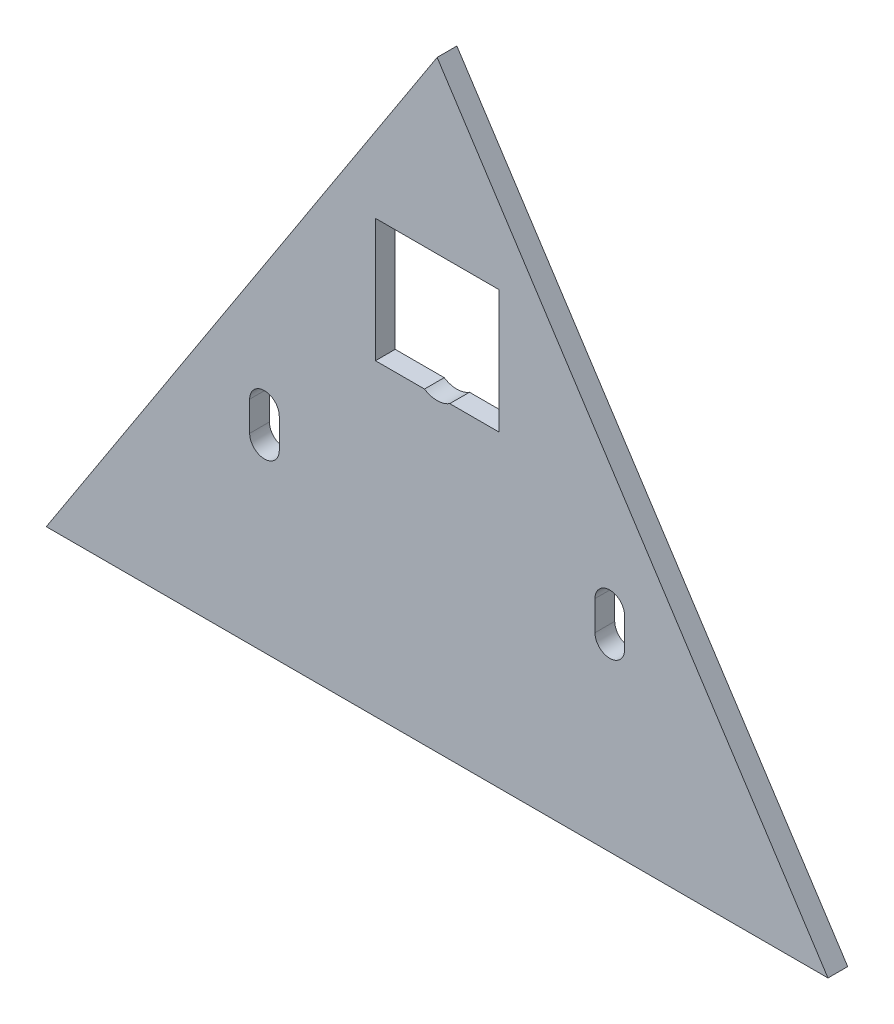
ISO-10303-21;
HEADER;
FILE_DESCRIPTION(('STEP AP214'),'2;1');
FILE_NAME('part.step','',(''),(''),'','','');
FILE_SCHEMA(('AUTOMOTIVE_DESIGN { 1 0 10303 214 1 1 1 1 }'));
ENDSEC;
DATA;
#1=APPLICATION_CONTEXT('core data for automotive mechanical design processes');
#2=APPLICATION_PROTOCOL_DEFINITION('international standard','automotive_design',2000,#1);
#3=PRODUCT_CONTEXT('',#1,'mechanical');
#4=PRODUCT('Part','Part','',(#3));
#5=PRODUCT_RELATED_PRODUCT_CATEGORY('part','',(#4));
#6=PRODUCT_DEFINITION_FORMATION('','',#4);
#7=PRODUCT_DEFINITION_CONTEXT('part definition',#1,'design');
#8=PRODUCT_DEFINITION('design','',#6,#7);
#9=PRODUCT_DEFINITION_SHAPE('','',#8);
#10=(LENGTH_UNIT() NAMED_UNIT(*) SI_UNIT(.MILLI.,.METRE.));
#11=(NAMED_UNIT(*) PLANE_ANGLE_UNIT() SI_UNIT($,.RADIAN.));
#12=(NAMED_UNIT(*) SI_UNIT($,.STERADIAN.) SOLID_ANGLE_UNIT());
#13=UNCERTAINTY_MEASURE_WITH_UNIT(LENGTH_MEASURE(1.E-05),#10,'distance_accuracy_value','');
#14=(GEOMETRIC_REPRESENTATION_CONTEXT(3) GLOBAL_UNCERTAINTY_ASSIGNED_CONTEXT((#13)) GLOBAL_UNIT_ASSIGNED_CONTEXT((#10,
#11,#12)) REPRESENTATION_CONTEXT('',''));
#15=CARTESIAN_POINT('',(0.,0.,0.));
#16=DIRECTION('',(0.,0.,1.));
#17=DIRECTION('',(1.,0.,0.));
#18=AXIS2_PLACEMENT_3D('',#15,#16,#17);
#19=CARTESIAN_POINT('',(24.9999999999998,453.506957122001,-32.0000000000005));
#20=DIRECTION('',(0.,-1.,0.));
#21=DIRECTION('',(0.,0.,-1.));
#22=AXIS2_PLACEMENT_3D('',#19,#20,#21);
#23=PLANE('',#22);
#24=DIRECTION('',(-1.,0.,0.));
#25=VECTOR('',#24,1.);
#26=CARTESIAN_POINT('',(24.9999999999998,453.506957122001,-32.0000000000005));
#27=LINE('',#26,#25);
#28=CARTESIAN_POINT('',(-5.12347538297992,453.506957122001,-32.0000000000004));
#29=VERTEX_POINT('',#28);
#30=CARTESIAN_POINT('',(-25.0000000000002,453.506957122001,-32.0000000000003));
#31=VERTEX_POINT('',#30);
#32=EDGE_CURVE('E278',#29,#31,#27,.T.);
#33=ORIENTED_EDGE('',*,*,#32,.F.);
#34=DIRECTION('',(0.,0.,-1.));
#35=VECTOR('',#34,1.);
#36=CARTESIAN_POINT('',(-5.12347538297991,453.506957122001,-30.0000000000004));
#37=LINE('',#36,#35);
#38=CARTESIAN_POINT('',(-5.12347538297994,453.506957122001,-40.0000000000004));
#39=VERTEX_POINT('',#38);
#40=EDGE_CURVE('E12',#29,#39,#37,.T.);
#41=ORIENTED_EDGE('',*,*,#40,.T.);
#42=DIRECTION('',(-1.,0.,0.));
#43=VECTOR('',#42,1.);
#44=CARTESIAN_POINT('',(24.9999999999998,453.506957122001,-40.0000000000005));
#45=LINE('',#44,#43);
#46=CARTESIAN_POINT('',(-25.0000000000002,453.506957122001,-40.0000000000003));
#47=VERTEX_POINT('',#46);
#48=EDGE_CURVE('E180',#39,#47,#45,.T.);
#49=ORIENTED_EDGE('',*,*,#48,.T.);
#50=DIRECTION('',(0.,0.,-1.));
#51=VECTOR('',#50,1.);
#52=CARTESIAN_POINT('',(-25.0000000000002,453.506957122001,-32.0000000000003));
#53=LINE('',#52,#51);
#54=EDGE_CURVE('E200',#31,#47,#53,.T.);
#55=ORIENTED_EDGE('',*,*,#54,.F.);
#56=EDGE_LOOP('',(#33,#41,#49,#55));
#57=FACE_BOUND('',#56,.T.);
#58=ADVANCED_FACE('F46',(#57),#23,.F.);
#59=CARTESIAN_POINT('',(-158.455452740194,328.506957122001,-32.0000000000002));
#60=DIRECTION('',(-0.838670567945421,0.544639035015032,0.));
#61=DIRECTION('',(-0.544639035015032,-0.838670567945421,0.));
#62=AXIS2_PLACEMENT_3D('',#59,#60,#61);
#63=PLANE('',#62);
#64=DIRECTION('',(0.544639035015032,0.838670567945421,0.));
#65=VECTOR('',#64,1.);
#66=CARTESIAN_POINT('',(-158.455452740194,328.506957122001,-40.0000000000002));
#67=LINE('',#66,#65);
#68=CARTESIAN_POINT('',(-158.455452740194,328.506957122001,-40.0000000000002));
#69=VERTEX_POINT('',#68);
#70=CARTESIAN_POINT('',(0.,572.506957122,-40.0000000000002));
#71=VERTEX_POINT('',#70);
#72=EDGE_CURVE('E204',#69,#71,#67,.T.);
#73=ORIENTED_EDGE('',*,*,#72,.F.);
#74=DIRECTION('',(0.,0.,-1.));
#75=VECTOR('',#74,1.);
#76=CARTESIAN_POINT('',(-158.455452740194,328.506957122001,-32.0000000000002));
#77=LINE('',#76,#75);
#78=CARTESIAN_POINT('',(-158.455452740194,328.506957122001,-32.0000000000002));
#79=VERTEX_POINT('',#78);
#80=EDGE_CURVE('E171',#79,#69,#77,.T.);
#81=ORIENTED_EDGE('',*,*,#80,.F.);
#82=DIRECTION('',(0.544639035015032,0.838670567945421,0.));
#83=VECTOR('',#82,1.);
#84=CARTESIAN_POINT('',(-158.455452740194,328.506957122001,-32.0000000000002));
#85=LINE('',#84,#83);
#86=CARTESIAN_POINT('',(0.,572.506957122,-32.0000000000002));
#87=VERTEX_POINT('',#86);
#88=EDGE_CURVE('E215',#79,#87,#85,.T.);
#89=ORIENTED_EDGE('',*,*,#88,.T.);
#90=DIRECTION('',(0.,0.,-1.));
#91=VECTOR('',#90,1.);
#92=CARTESIAN_POINT('',(0.,572.506957122,-32.0000000000002));
#93=LINE('',#92,#91);
#94=EDGE_CURVE('E232',#87,#71,#93,.T.);
#95=ORIENTED_EDGE('',*,*,#94,.T.);
#96=EDGE_LOOP('',(#73,#81,#89,#95));
#97=FACE_BOUND('',#96,.T.);
#98=ADVANCED_FACE('F48',(#97),#63,.T.);
#99=CARTESIAN_POINT('',(158.455452740191,328.506957122001,-32.0000000000012));
#100=DIRECTION('',(0.,-1.,0.));
#101=DIRECTION('',(0.,0.,-1.));
#102=AXIS2_PLACEMENT_3D('',#99,#100,#101);
#103=PLANE('',#102);
#104=DIRECTION('',(-1.,0.,0.));
#105=VECTOR('',#104,1.);
#106=CARTESIAN_POINT('',(158.455452740191,328.506957122001,-40.0000000000012));
#107=LINE('',#106,#105);
#108=CARTESIAN_POINT('',(158.455452740191,328.506957122001,-40.0000000000012));
#109=VERTEX_POINT('',#108);
#110=EDGE_CURVE('E220',#109,#69,#107,.T.);
#111=ORIENTED_EDGE('',*,*,#110,.F.);
#112=DIRECTION('',(0.,0.,-1.));
#113=VECTOR('',#112,1.);
#114=CARTESIAN_POINT('',(158.455452740191,328.506957122001,-32.0000000000012));
#115=LINE('',#114,#113);
#116=CARTESIAN_POINT('',(158.455452740191,328.506957122001,-32.0000000000012));
#117=VERTEX_POINT('',#116);
#118=EDGE_CURVE('E245',#117,#109,#115,.T.);
#119=ORIENTED_EDGE('',*,*,#118,.F.);
#120=DIRECTION('',(-1.,0.,0.));
#121=VECTOR('',#120,1.);
#122=CARTESIAN_POINT('',(158.455452740191,328.506957122001,-32.0000000000012));
#123=LINE('',#122,#121);
#124=EDGE_CURVE('E227',#117,#79,#123,.T.);
#125=ORIENTED_EDGE('',*,*,#124,.T.);
#126=ORIENTED_EDGE('',*,*,#80,.T.);
#127=EDGE_LOOP('',(#111,#119,#125,#126));
#128=FACE_BOUND('',#127,.T.);
#129=ADVANCED_FACE('F262',(#128),#103,.T.);
#130=CARTESIAN_POINT('',(0.,572.506957122,-32.0000000000002));
#131=DIRECTION('',(0.838670567945427,0.544639035015022,0.));
#132=DIRECTION('',(-0.544639035015022,0.838670567945427,0.));
#133=AXIS2_PLACEMENT_3D('',#130,#131,#132);
#134=PLANE('',#133);
#135=DIRECTION('',(0.544639035015022,-0.838670567945427,0.));
#136=VECTOR('',#135,1.);
#137=CARTESIAN_POINT('',(0.,572.506957122,-40.0000000000002));
#138=LINE('',#137,#136);
#139=EDGE_CURVE('E236',#71,#109,#138,.T.);
#140=ORIENTED_EDGE('',*,*,#139,.F.);
#141=ORIENTED_EDGE('',*,*,#94,.F.);
#142=DIRECTION('',(0.544639035015022,-0.838670567945427,0.));
#143=VECTOR('',#142,1.);
#144=CARTESIAN_POINT('',(0.,572.506957122,-32.0000000000002));
#145=LINE('',#144,#143);
#146=EDGE_CURVE('E219',#87,#117,#145,.T.);
#147=ORIENTED_EDGE('',*,*,#146,.T.);
#148=ORIENTED_EDGE('',*,*,#118,.T.);
#149=EDGE_LOOP('',(#140,#141,#147,#148));
#150=FACE_BOUND('',#149,.T.);
#151=ADVANCED_FACE('F258',(#150),#134,.T.);
#152=CARTESIAN_POINT('',(-1.02960238396592E-13,0.,-32.0000000000014));
#153=DIRECTION('',(0.,0.,-1.));
#154=DIRECTION('',(-1.,0.,0.));
#155=AXIS2_PLACEMENT_3D('',#152,#153,#154);
#156=PLANE('',#155);
#157=DIRECTION('',(0.,1.,0.));
#158=VECTOR('',#157,1.);
#159=CARTESIAN_POINT('',(-76.0000000000002,414.506957122,-32.0000000000003));
#160=LINE('',#159,#158);
#161=CARTESIAN_POINT('',(-76.0000000000002,402.506957122001,-32.0000000000003));
#162=VERTEX_POINT('',#161);
#163=CARTESIAN_POINT('',(-76.0000000000002,414.506957122,-32.0000000000003));
#164=VERTEX_POINT('',#163);
#165=EDGE_CURVE('E331',#162,#164,#160,.T.);
#166=ORIENTED_EDGE('',*,*,#165,.T.);
#167=CARTESIAN_POINT('',(-70.0000000000001,414.506957122001,-32.0000000000003));
#168=DIRECTION('',(0.,0.,-1.));
#169=DIRECTION('',(1.,0.,0.));
#170=AXIS2_PLACEMENT_3D('',#167,#168,#169);
#171=CIRCLE('',#170,6.00000000000005);
#172=CARTESIAN_POINT('',(-64.0000000000001,414.506957122,-32.0000000000003));
#173=VERTEX_POINT('',#172);
#174=EDGE_CURVE('E339',#164,#173,#171,.T.);
#175=ORIENTED_EDGE('',*,*,#174,.T.);
#176=DIRECTION('',(0.,-1.,0.));
#177=VECTOR('',#176,1.);
#178=CARTESIAN_POINT('',(-64.0000000000001,414.506957122,-32.0000000000003));
#179=LINE('',#178,#177);
#180=CARTESIAN_POINT('',(-64.0000000000001,402.506957122001,-32.0000000000003));
#181=VERTEX_POINT('',#180);
#182=EDGE_CURVE('E332',#173,#181,#179,.T.);
#183=ORIENTED_EDGE('',*,*,#182,.T.);
#184=CARTESIAN_POINT('',(-70.0000000000001,402.506957122001,-32.0000000000003));
#185=DIRECTION('',(0.,0.,-1.));
#186=DIRECTION('',(1.,0.,0.));
#187=AXIS2_PLACEMENT_3D('',#184,#185,#186);
#188=CIRCLE('',#187,6.00000000000005);
#189=EDGE_CURVE('E70',#181,#162,#188,.T.);
#190=ORIENTED_EDGE('',*,*,#189,.T.);
#191=EDGE_LOOP('',(#166,#175,#183,#190));
#192=FACE_BOUND('',#191,.T.);
#193=DIRECTION('',(0.,1.,0.));
#194=VECTOR('',#193,1.);
#195=CARTESIAN_POINT('',(63.9999999999999,414.506957122,-32.0000000000007));
#196=LINE('',#195,#194);
#197=CARTESIAN_POINT('',(63.9999999999999,402.506957122001,-32.0000000000007));
#198=VERTEX_POINT('',#197);
#199=CARTESIAN_POINT('',(63.9999999999999,414.506957122,-32.0000000000007));
#200=VERTEX_POINT('',#199);
#201=EDGE_CURVE('E305',#198,#200,#196,.T.);
#202=ORIENTED_EDGE('',*,*,#201,.T.);
#203=CARTESIAN_POINT('',(69.9999999999999,414.506957122001,-32.0000000000007));
#204=DIRECTION('',(0.,0.,-1.));
#205=DIRECTION('',(-1.,0.,0.));
#206=AXIS2_PLACEMENT_3D('',#203,#204,#205);
#207=CIRCLE('',#206,6.00000000000005);
#208=CARTESIAN_POINT('',(76.,414.506957122,-32.0000000000008));
#209=VERTEX_POINT('',#208);
#210=EDGE_CURVE('E313',#200,#209,#207,.T.);
#211=ORIENTED_EDGE('',*,*,#210,.T.);
#212=DIRECTION('',(0.,-1.,0.));
#213=VECTOR('',#212,1.);
#214=CARTESIAN_POINT('',(76.,414.506957122,-32.0000000000008));
#215=LINE('',#214,#213);
#216=CARTESIAN_POINT('',(76.,402.506957122001,-32.0000000000008));
#217=VERTEX_POINT('',#216);
#218=EDGE_CURVE('E306',#209,#217,#215,.T.);
#219=ORIENTED_EDGE('',*,*,#218,.T.);
#220=CARTESIAN_POINT('',(69.9999999999999,402.506957122001,-32.0000000000008));
#221=DIRECTION('',(0.,0.,-1.));
#222=DIRECTION('',(-1.,0.,0.));
#223=AXIS2_PLACEMENT_3D('',#220,#221,#222);
#224=CIRCLE('',#223,6.00000000000005);
#225=EDGE_CURVE('E301',#217,#198,#224,.T.);
#226=ORIENTED_EDGE('',*,*,#225,.T.);
#227=EDGE_LOOP('',(#202,#211,#219,#226));
#228=FACE_BOUND('',#227,.T.);
#229=CARTESIAN_POINT('',(24.9999999999998,453.506957122001,-32.0000000000005));
#230=VERTEX_POINT('',#229);
#231=CARTESIAN_POINT('',(5.12347538297969,453.506957122001,-32.0000000000004));
#232=VERTEX_POINT('',#231);
#233=EDGE_CURVE('E214',#230,#232,#27,.T.);
#234=ORIENTED_EDGE('',*,*,#233,.T.);
#235=CARTESIAN_POINT('',(-1.06382445730871E-13,461.506957122001,-32.0000000000004));
#236=DIRECTION('',(0.,0.,-1.));
#237=DIRECTION('',(-1.,0.,0.));
#238=AXIS2_PLACEMENT_3D('',#235,#236,#237);
#239=CIRCLE('',#238,9.50000000000001);
#240=EDGE_CURVE('E62',#232,#29,#239,.T.);
#241=ORIENTED_EDGE('',*,*,#240,.T.);
#242=ORIENTED_EDGE('',*,*,#32,.T.);
#243=DIRECTION('',(0.,1.,0.));
#244=VECTOR('',#243,1.);
#245=CARTESIAN_POINT('',(-25.0000000000002,503.506957122,-32.0000000000002));
#246=LINE('',#245,#244);
#247=CARTESIAN_POINT('',(-25.0000000000002,503.506957122,-32.0000000000002));
#248=VERTEX_POINT('',#247);
#249=EDGE_CURVE('E187',#31,#248,#246,.T.);
#250=ORIENTED_EDGE('',*,*,#249,.T.);
#251=DIRECTION('',(1.,0.,0.));
#252=VECTOR('',#251,1.);
#253=CARTESIAN_POINT('',(24.9999999999998,503.506957122001,-32.0000000000004));
#254=LINE('',#253,#252);
#255=CARTESIAN_POINT('',(24.9999999999998,503.506957122001,-32.0000000000004));
#256=VERTEX_POINT('',#255);
#257=EDGE_CURVE('E193',#248,#256,#254,.T.);
#258=ORIENTED_EDGE('',*,*,#257,.T.);
#259=DIRECTION('',(0.,-1.,0.));
#260=VECTOR('',#259,1.);
#261=CARTESIAN_POINT('',(24.9999999999998,503.506957122001,-32.0000000000004));
#262=LINE('',#261,#260);
#263=EDGE_CURVE('E274',#256,#230,#262,.T.);
#264=ORIENTED_EDGE('',*,*,#263,.T.);
#265=EDGE_LOOP('',(#234,#241,#242,#250,#258,#264));
#266=FACE_BOUND('',#265,.T.);
#267=ORIENTED_EDGE('',*,*,#88,.F.);
#268=ORIENTED_EDGE('',*,*,#124,.F.);
#269=ORIENTED_EDGE('',*,*,#146,.F.);
#270=EDGE_LOOP('',(#267,#268,#269));
#271=FACE_BOUND('',#270,.T.);
#272=ADVANCED_FACE('F265',(#192,#228,#266,#271),#156,.F.);
#273=CARTESIAN_POINT('',(-1.28745005139942E-13,0.,-40.0000000000014));
#274=DIRECTION('',(0.,0.,-1.));
#275=DIRECTION('',(-1.,0.,0.));
#276=AXIS2_PLACEMENT_3D('',#273,#274,#275);
#277=PLANE('',#276);
#278=CARTESIAN_POINT('',(-1.32214452091896E-13,461.506957122001,-40.0000000000004));
#279=DIRECTION('',(0.,0.,-1.));
#280=DIRECTION('',(-1.,0.,0.));
#281=AXIS2_PLACEMENT_3D('',#278,#279,#280);
#282=CIRCLE('',#281,9.50000000000001);
#283=CARTESIAN_POINT('',(5.12347538297968,453.506957122001,-40.0000000000004));
#284=VERTEX_POINT('',#283);
#285=EDGE_CURVE('E165',#284,#39,#282,.T.);
#286=ORIENTED_EDGE('',*,*,#285,.F.);
#287=CARTESIAN_POINT('',(24.9999999999998,453.506957122001,-40.0000000000005));
#288=VERTEX_POINT('',#287);
#289=EDGE_CURVE('E178',#288,#284,#45,.T.);
#290=ORIENTED_EDGE('',*,*,#289,.F.);
#291=DIRECTION('',(0.,-1.,0.));
#292=VECTOR('',#291,1.);
#293=CARTESIAN_POINT('',(24.9999999999998,503.506957122001,-40.0000000000004));
#294=LINE('',#293,#292);
#295=CARTESIAN_POINT('',(24.9999999999998,503.506957122001,-40.0000000000004));
#296=VERTEX_POINT('',#295);
#297=EDGE_CURVE('E196',#296,#288,#294,.T.);
#298=ORIENTED_EDGE('',*,*,#297,.F.);
#299=DIRECTION('',(1.,0.,0.));
#300=VECTOR('',#299,1.);
#301=CARTESIAN_POINT('',(24.9999999999998,503.506957122001,-40.0000000000004));
#302=LINE('',#301,#300);
#303=CARTESIAN_POINT('',(-25.0000000000002,503.506957122001,-40.0000000000002));
#304=VERTEX_POINT('',#303);
#305=EDGE_CURVE('E669',#304,#296,#302,.T.);
#306=ORIENTED_EDGE('',*,*,#305,.F.);
#307=DIRECTION('',(0.,1.,0.));
#308=VECTOR('',#307,1.);
#309=CARTESIAN_POINT('',(-25.0000000000002,503.506957122,-40.0000000000002));
#310=LINE('',#309,#308);
#311=EDGE_CURVE('E392',#47,#304,#310,.T.);
#312=ORIENTED_EDGE('',*,*,#311,.F.);
#313=ORIENTED_EDGE('',*,*,#48,.F.);
#314=EDGE_LOOP('',(#286,#290,#298,#306,#312,#313));
#315=FACE_BOUND('',#314,.T.);
#316=CARTESIAN_POINT('',(-70.0000000000001,414.506957122001,-40.0000000000003));
#317=DIRECTION('',(0.,0.,-1.));
#318=DIRECTION('',(1.,0.,0.));
#319=AXIS2_PLACEMENT_3D('',#316,#317,#318);
#320=CIRCLE('',#319,6.00000000000005);
#321=CARTESIAN_POINT('',(-76.0000000000002,414.506957122,-40.0000000000003));
#322=VERTEX_POINT('',#321);
#323=CARTESIAN_POINT('',(-64.0000000000001,414.506957122,-40.0000000000003));
#324=VERTEX_POINT('',#323);
#325=EDGE_CURVE('E295',#322,#324,#320,.T.);
#326=ORIENTED_EDGE('',*,*,#325,.F.);
#327=DIRECTION('',(0.,1.,0.));
#328=VECTOR('',#327,1.);
#329=CARTESIAN_POINT('',(-76.0000000000002,414.506957122,-40.0000000000003));
#330=LINE('',#329,#328);
#331=CARTESIAN_POINT('',(-76.0000000000002,402.506957122001,-40.0000000000003));
#332=VERTEX_POINT('',#331);
#333=EDGE_CURVE('E345',#332,#322,#330,.T.);
#334=ORIENTED_EDGE('',*,*,#333,.F.);
#335=CARTESIAN_POINT('',(-70.0000000000001,402.506957122001,-40.0000000000003));
#336=DIRECTION('',(0.,0.,-1.));
#337=DIRECTION('',(1.,0.,0.));
#338=AXIS2_PLACEMENT_3D('',#335,#336,#337);
#339=CIRCLE('',#338,6.00000000000005);
#340=CARTESIAN_POINT('',(-64.0000000000001,402.506957122001,-40.0000000000003));
#341=VERTEX_POINT('',#340);
#342=EDGE_CURVE('E423',#341,#332,#339,.T.);
#343=ORIENTED_EDGE('',*,*,#342,.F.);
#344=DIRECTION('',(0.,-1.,0.));
#345=VECTOR('',#344,1.);
#346=CARTESIAN_POINT('',(-64.0000000000001,414.506957122,-40.0000000000003));
#347=LINE('',#346,#345);
#348=EDGE_CURVE('E427',#324,#341,#347,.T.);
#349=ORIENTED_EDGE('',*,*,#348,.F.);
#350=EDGE_LOOP('',(#326,#334,#343,#349));
#351=FACE_BOUND('',#350,.T.);
#352=CARTESIAN_POINT('',(69.9999999999999,414.506957122001,-40.0000000000007));
#353=DIRECTION('',(0.,0.,-1.));
#354=DIRECTION('',(-1.,0.,0.));
#355=AXIS2_PLACEMENT_3D('',#352,#353,#354);
#356=CIRCLE('',#355,6.00000000000005);
#357=CARTESIAN_POINT('',(63.9999999999998,414.506957122,-40.0000000000007));
#358=VERTEX_POINT('',#357);
#359=CARTESIAN_POINT('',(75.9999999999999,414.506957122,-40.0000000000007));
#360=VERTEX_POINT('',#359);
#361=EDGE_CURVE('E369',#358,#360,#356,.T.);
#362=ORIENTED_EDGE('',*,*,#361,.F.);
#363=DIRECTION('',(0.,1.,0.));
#364=VECTOR('',#363,1.);
#365=CARTESIAN_POINT('',(63.9999999999998,414.506957122,-40.0000000000007));
#366=LINE('',#365,#364);
#367=CARTESIAN_POINT('',(63.9999999999998,402.506957122001,-40.0000000000007));
#368=VERTEX_POINT('',#367);
#369=EDGE_CURVE('E319',#368,#358,#366,.T.);
#370=ORIENTED_EDGE('',*,*,#369,.F.);
#371=CARTESIAN_POINT('',(69.9999999999999,402.506957122001,-40.0000000000008));
#372=DIRECTION('',(0.,0.,-1.));
#373=DIRECTION('',(-1.,0.,0.));
#374=AXIS2_PLACEMENT_3D('',#371,#372,#373);
#375=CIRCLE('',#374,6.00000000000005);
#376=CARTESIAN_POINT('',(75.9999999999999,402.506957122001,-40.0000000000008));
#377=VERTEX_POINT('',#376);
#378=EDGE_CURVE('E378',#377,#368,#375,.T.);
#379=ORIENTED_EDGE('',*,*,#378,.F.);
#380=DIRECTION('',(0.,-1.,0.));
#381=VECTOR('',#380,1.);
#382=CARTESIAN_POINT('',(75.9999999999999,414.506957122,-40.0000000000008));
#383=LINE('',#382,#381);
#384=EDGE_CURVE('E373',#360,#377,#383,.T.);
#385=ORIENTED_EDGE('',*,*,#384,.F.);
#386=EDGE_LOOP('',(#362,#370,#379,#385));
#387=FACE_BOUND('',#386,.T.);
#388=ORIENTED_EDGE('',*,*,#72,.T.);
#389=ORIENTED_EDGE('',*,*,#139,.T.);
#390=ORIENTED_EDGE('',*,*,#110,.T.);
#391=EDGE_LOOP('',(#388,#389,#390));
#392=FACE_BOUND('',#391,.T.);
#393=ADVANCED_FACE('F175',(#315,#351,#387,#392),#277,.T.);
#394=CARTESIAN_POINT('',(-25.0000000000002,503.506957122,-32.0000000000002));
#395=DIRECTION('',(-1.,0.,0.));
#396=DIRECTION('',(0.,0.,1.));
#397=AXIS2_PLACEMENT_3D('',#394,#395,#396);
#398=PLANE('',#397);
#399=ORIENTED_EDGE('',*,*,#311,.T.);
#400=DIRECTION('',(0.,0.,-1.));
#401=VECTOR('',#400,1.);
#402=CARTESIAN_POINT('',(-25.0000000000002,503.506957122,-32.0000000000002));
#403=LINE('',#402,#401);
#404=EDGE_CURVE('E210',#248,#304,#403,.T.);
#405=ORIENTED_EDGE('',*,*,#404,.F.);
#406=ORIENTED_EDGE('',*,*,#249,.F.);
#407=ORIENTED_EDGE('',*,*,#54,.T.);
#408=EDGE_LOOP('',(#399,#405,#406,#407));
#409=FACE_BOUND('',#408,.T.);
#410=ADVANCED_FACE('F477',(#409),#398,.F.);
#411=ORIENTED_EDGE('',*,*,#289,.T.);
#412=DIRECTION('',(0.,0.,-1.));
#413=VECTOR('',#412,1.);
#414=CARTESIAN_POINT('',(5.12347538297971,453.506957122001,-30.0000000000004));
#415=LINE('',#414,#413);
#416=EDGE_CURVE('E55',#284,#232,#415,.F.);
#417=ORIENTED_EDGE('',*,*,#416,.T.);
#418=ORIENTED_EDGE('',*,*,#233,.F.);
#419=DIRECTION('',(0.,0.,-1.));
#420=VECTOR('',#419,1.);
#421=CARTESIAN_POINT('',(24.9999999999998,453.506957122001,-32.0000000000005));
#422=LINE('',#421,#420);
#423=EDGE_CURVE('E184',#230,#288,#422,.T.);
#424=ORIENTED_EDGE('',*,*,#423,.T.);
#425=EDGE_LOOP('',(#411,#417,#418,#424));
#426=FACE_BOUND('',#425,.T.);
#427=ADVANCED_FACE('F183',(#426),#23,.F.);
#428=CARTESIAN_POINT('',(24.9999999999998,503.506957122001,-32.0000000000004));
#429=DIRECTION('',(1.,0.,0.));
#430=DIRECTION('',(0.,0.,-1.));
#431=AXIS2_PLACEMENT_3D('',#428,#429,#430);
#432=PLANE('',#431);
#433=ORIENTED_EDGE('',*,*,#297,.T.);
#434=ORIENTED_EDGE('',*,*,#423,.F.);
#435=ORIENTED_EDGE('',*,*,#263,.F.);
#436=DIRECTION('',(0.,0.,-1.));
#437=VECTOR('',#436,1.);
#438=CARTESIAN_POINT('',(24.9999999999998,503.506957122001,-32.0000000000004));
#439=LINE('',#438,#437);
#440=EDGE_CURVE('E207',#256,#296,#439,.T.);
#441=ORIENTED_EDGE('',*,*,#440,.T.);
#442=EDGE_LOOP('',(#433,#434,#435,#441));
#443=FACE_BOUND('',#442,.T.);
#444=ADVANCED_FACE('F476',(#443),#432,.F.);
#445=CARTESIAN_POINT('',(24.9999999999998,503.506957122001,-32.0000000000004));
#446=DIRECTION('',(0.,1.,0.));
#447=DIRECTION('',(-1.,0.,0.));
#448=AXIS2_PLACEMENT_3D('',#445,#446,#447);
#449=PLANE('',#448);
#450=ORIENTED_EDGE('',*,*,#305,.T.);
#451=ORIENTED_EDGE('',*,*,#440,.F.);
#452=ORIENTED_EDGE('',*,*,#257,.F.);
#453=ORIENTED_EDGE('',*,*,#404,.T.);
#454=EDGE_LOOP('',(#450,#451,#452,#453));
#455=FACE_BOUND('',#454,.T.);
#456=ADVANCED_FACE('F482',(#455),#449,.F.);
#457=CARTESIAN_POINT('',(69.9999999999999,414.506957122001,-32.0000000000007));
#458=DIRECTION('',(0.,0.,-1.));
#459=DIRECTION('',(-1.,0.,0.));
#460=AXIS2_PLACEMENT_3D('',#457,#458,#459);
#461=CYLINDRICAL_SURFACE('',#460,6.00000000000005);
#462=ORIENTED_EDGE('',*,*,#361,.T.);
#463=DIRECTION('',(0.,0.,-1.));
#464=VECTOR('',#463,1.);
#465=CARTESIAN_POINT('',(76.,414.506957122,-32.0000000000008));
#466=LINE('',#465,#464);
#467=EDGE_CURVE('E325',#209,#360,#466,.T.);
#468=ORIENTED_EDGE('',*,*,#467,.F.);
#469=ORIENTED_EDGE('',*,*,#210,.F.);
#470=DIRECTION('',(0.,0.,-1.));
#471=VECTOR('',#470,1.);
#472=CARTESIAN_POINT('',(63.9999999999999,414.506957122,-32.0000000000007));
#473=LINE('',#472,#471);
#474=EDGE_CURVE('E390',#200,#358,#473,.T.);
#475=ORIENTED_EDGE('',*,*,#474,.T.);
#476=EDGE_LOOP('',(#462,#468,#469,#475));
#477=FACE_BOUND('',#476,.T.);
#478=ADVANCED_FACE('F539',(#477),#461,.F.);
#479=CARTESIAN_POINT('',(63.9999999999999,414.506957122,-32.0000000000007));
#480=DIRECTION('',(-1.,0.,0.));
#481=DIRECTION('',(0.,0.,1.));
#482=AXIS2_PLACEMENT_3D('',#479,#480,#481);
#483=PLANE('',#482);
#484=ORIENTED_EDGE('',*,*,#369,.T.);
#485=ORIENTED_EDGE('',*,*,#474,.F.);
#486=ORIENTED_EDGE('',*,*,#201,.F.);
#487=DIRECTION('',(0.,0.,-1.));
#488=VECTOR('',#487,1.);
#489=CARTESIAN_POINT('',(63.9999999999999,402.506957122001,-32.0000000000007));
#490=LINE('',#489,#488);
#491=EDGE_CURVE('E393',#198,#368,#490,.T.);
#492=ORIENTED_EDGE('',*,*,#491,.T.);
#493=EDGE_LOOP('',(#484,#485,#486,#492));
#494=FACE_BOUND('',#493,.T.);
#495=ADVANCED_FACE('F549',(#494),#483,.F.);
#496=CARTESIAN_POINT('',(69.9999999999999,402.506957122001,-32.0000000000008));
#497=DIRECTION('',(0.,0.,-1.));
#498=DIRECTION('',(-1.,0.,0.));
#499=AXIS2_PLACEMENT_3D('',#496,#497,#498);
#500=CYLINDRICAL_SURFACE('',#499,6.00000000000005);
#501=ORIENTED_EDGE('',*,*,#378,.T.);
#502=ORIENTED_EDGE('',*,*,#491,.F.);
#503=ORIENTED_EDGE('',*,*,#225,.F.);
#504=DIRECTION('',(0.,0.,-1.));
#505=VECTOR('',#504,1.);
#506=CARTESIAN_POINT('',(76.,402.506957122001,-32.0000000000008));
#507=LINE('',#506,#505);
#508=EDGE_CURVE('E396',#217,#377,#507,.T.);
#509=ORIENTED_EDGE('',*,*,#508,.T.);
#510=EDGE_LOOP('',(#501,#502,#503,#509));
#511=FACE_BOUND('',#510,.T.);
#512=ADVANCED_FACE('F560',(#511),#500,.F.);
#513=CARTESIAN_POINT('',(76.,414.506957122,-32.0000000000008));
#514=DIRECTION('',(1.,0.,0.));
#515=DIRECTION('',(0.,0.,-1.));
#516=AXIS2_PLACEMENT_3D('',#513,#514,#515);
#517=PLANE('',#516);
#518=ORIENTED_EDGE('',*,*,#384,.T.);
#519=ORIENTED_EDGE('',*,*,#508,.F.);
#520=ORIENTED_EDGE('',*,*,#218,.F.);
#521=ORIENTED_EDGE('',*,*,#467,.T.);
#522=EDGE_LOOP('',(#518,#519,#520,#521));
#523=FACE_BOUND('',#522,.T.);
#524=ADVANCED_FACE('F463',(#523),#517,.F.);
#525=CARTESIAN_POINT('',(-70.0000000000001,414.506957122001,-32.0000000000003));
#526=DIRECTION('',(0.,0.,-1.));
#527=DIRECTION('',(-1.,0.,0.));
#528=AXIS2_PLACEMENT_3D('',#525,#526,#527);
#529=CYLINDRICAL_SURFACE('',#528,6.00000000000005);
#530=ORIENTED_EDGE('',*,*,#325,.T.);
#531=DIRECTION('',(0.,0.,-1.));
#532=VECTOR('',#531,1.);
#533=CARTESIAN_POINT('',(-64.0000000000001,414.506957122,-32.0000000000003));
#534=LINE('',#533,#532);
#535=EDGE_CURVE('E350',#173,#324,#534,.T.);
#536=ORIENTED_EDGE('',*,*,#535,.F.);
#537=ORIENTED_EDGE('',*,*,#174,.F.);
#538=DIRECTION('',(0.,0.,-1.));
#539=VECTOR('',#538,1.);
#540=CARTESIAN_POINT('',(-76.0000000000002,414.506957122,-32.0000000000003));
#541=LINE('',#540,#539);
#542=EDGE_CURVE('E365',#164,#322,#541,.T.);
#543=ORIENTED_EDGE('',*,*,#542,.T.);
#544=EDGE_LOOP('',(#530,#536,#537,#543));
#545=FACE_BOUND('',#544,.T.);
#546=ADVANCED_FACE('F441',(#545),#529,.F.);
#547=CARTESIAN_POINT('',(-76.0000000000002,414.506957122,-32.0000000000003));
#548=DIRECTION('',(-1.,0.,0.));
#549=DIRECTION('',(0.,0.,1.));
#550=AXIS2_PLACEMENT_3D('',#547,#548,#549);
#551=PLANE('',#550);
#552=ORIENTED_EDGE('',*,*,#333,.T.);
#553=ORIENTED_EDGE('',*,*,#542,.F.);
#554=ORIENTED_EDGE('',*,*,#165,.F.);
#555=DIRECTION('',(0.,0.,-1.));
#556=VECTOR('',#555,1.);
#557=CARTESIAN_POINT('',(-76.0000000000002,402.506957122001,-32.0000000000003));
#558=LINE('',#557,#556);
#559=EDGE_CURVE('E361',#162,#332,#558,.T.);
#560=ORIENTED_EDGE('',*,*,#559,.T.);
#561=EDGE_LOOP('',(#552,#553,#554,#560));
#562=FACE_BOUND('',#561,.T.);
#563=ADVANCED_FACE('F455',(#562),#551,.F.);
#564=CARTESIAN_POINT('',(-70.0000000000001,402.506957122001,-32.0000000000003));
#565=DIRECTION('',(0.,0.,-1.));
#566=DIRECTION('',(-1.,0.,0.));
#567=AXIS2_PLACEMENT_3D('',#564,#565,#566);
#568=CYLINDRICAL_SURFACE('',#567,6.00000000000005);
#569=ORIENTED_EDGE('',*,*,#342,.T.);
#570=ORIENTED_EDGE('',*,*,#559,.F.);
#571=ORIENTED_EDGE('',*,*,#189,.F.);
#572=DIRECTION('',(0.,0.,-1.));
#573=VECTOR('',#572,1.);
#574=CARTESIAN_POINT('',(-64.0000000000001,402.506957122001,-32.0000000000003));
#575=LINE('',#574,#573);
#576=EDGE_CURVE('E357',#181,#341,#575,.T.);
#577=ORIENTED_EDGE('',*,*,#576,.T.);
#578=EDGE_LOOP('',(#569,#570,#571,#577));
#579=FACE_BOUND('',#578,.T.);
#580=ADVANCED_FACE('F450',(#579),#568,.F.);
#581=CARTESIAN_POINT('',(-64.0000000000001,414.506957122,-32.0000000000003));
#582=DIRECTION('',(1.,0.,0.));
#583=DIRECTION('',(0.,0.,-1.));
#584=AXIS2_PLACEMENT_3D('',#581,#582,#583);
#585=PLANE('',#584);
#586=ORIENTED_EDGE('',*,*,#348,.T.);
#587=ORIENTED_EDGE('',*,*,#576,.F.);
#588=ORIENTED_EDGE('',*,*,#182,.F.);
#589=ORIENTED_EDGE('',*,*,#535,.T.);
#590=EDGE_LOOP('',(#586,#587,#588,#589));
#591=FACE_BOUND('',#590,.T.);
#592=ADVANCED_FACE('F447',(#591),#585,.F.);
#593=CARTESIAN_POINT('',(0.,461.506957122001,-30.0000000000004));
#594=DIRECTION('',(0.,0.,-1.));
#595=DIRECTION('',(-1.,0.,0.));
#596=AXIS2_PLACEMENT_3D('',#593,#594,#595);
#597=CYLINDRICAL_SURFACE('',#596,9.50000000000001);
#598=ORIENTED_EDGE('',*,*,#240,.F.);
#599=ORIENTED_EDGE('',*,*,#416,.F.);
#600=ORIENTED_EDGE('',*,*,#285,.T.);
#601=ORIENTED_EDGE('',*,*,#40,.F.);
#602=EDGE_LOOP('',(#598,#599,#600,#601));
#603=FACE_BOUND('',#602,.T.);
#604=ADVANCED_FACE('F164',(#603),#597,.F.);
#605=CLOSED_SHELL('',(#58,#98,#129,#151,#272,#393,#410,#427,#444,#456,#478,#495,#512,#524,#546,
#563,#580,#592,#604));
#606=MANIFOLD_SOLID_BREP('B2',#605);
#607=ADVANCED_BREP_SHAPE_REPRESENTATION('',(#18,#606),#14);
#608=SHAPE_DEFINITION_REPRESENTATION(#9,#607);
ENDSEC;
END-ISO-10303-21;
